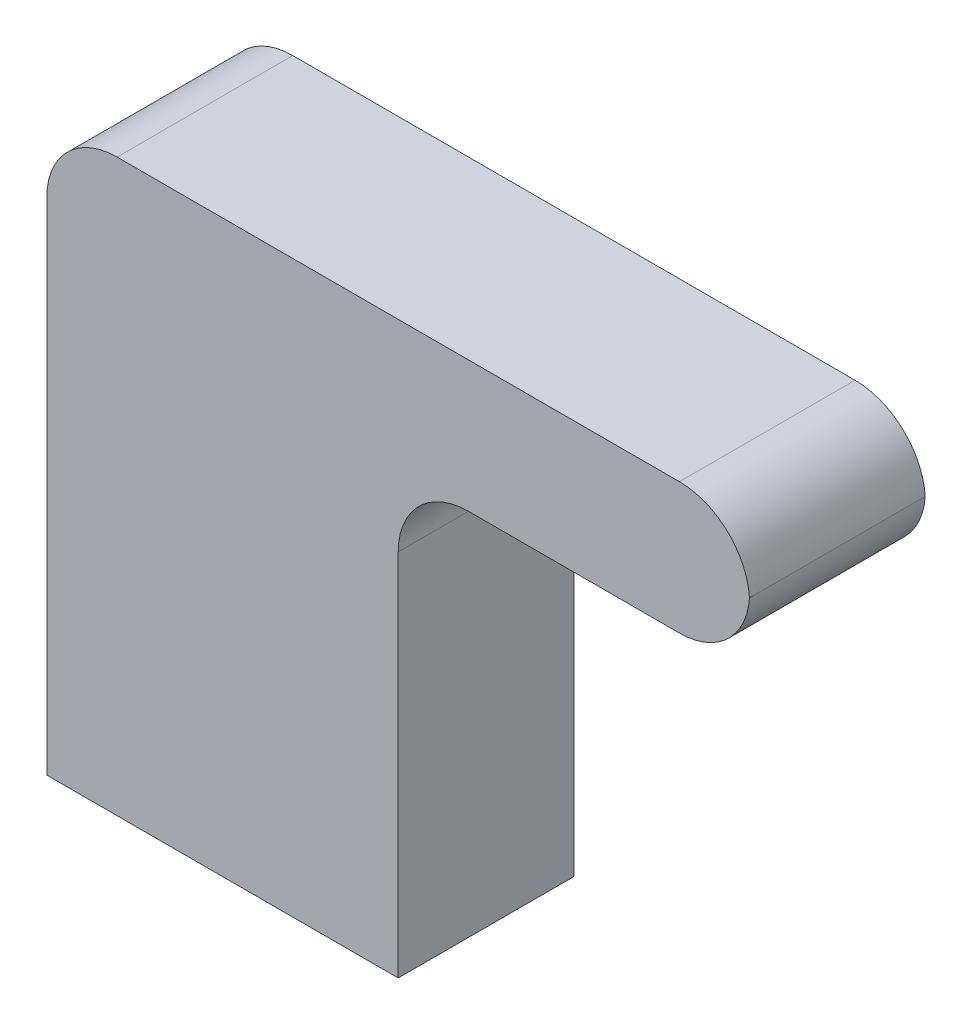
ISO-10303-21;
HEADER;
FILE_DESCRIPTION(('STEP AP214'),'2;1');
FILE_NAME('part.step','',(''),(''),'','','');
FILE_SCHEMA(('AUTOMOTIVE_DESIGN { 1 0 10303 214 1 1 1 1 }'));
ENDSEC;
DATA;
#1=APPLICATION_CONTEXT('core data for automotive mechanical design processes');
#2=APPLICATION_PROTOCOL_DEFINITION('international standard','automotive_design',2000,#1);
#3=PRODUCT_CONTEXT('',#1,'mechanical');
#4=PRODUCT('Part','Part','',(#3));
#5=PRODUCT_RELATED_PRODUCT_CATEGORY('part','',(#4));
#6=PRODUCT_DEFINITION_FORMATION('','',#4);
#7=PRODUCT_DEFINITION_CONTEXT('part definition',#1,'design');
#8=PRODUCT_DEFINITION('design','',#6,#7);
#9=PRODUCT_DEFINITION_SHAPE('','',#8);
#10=(LENGTH_UNIT() NAMED_UNIT(*) SI_UNIT(.MILLI.,.METRE.));
#11=(NAMED_UNIT(*) PLANE_ANGLE_UNIT() SI_UNIT($,.RADIAN.));
#12=(NAMED_UNIT(*) SI_UNIT($,.STERADIAN.) SOLID_ANGLE_UNIT());
#13=UNCERTAINTY_MEASURE_WITH_UNIT(LENGTH_MEASURE(1.E-05),#10,'distance_accuracy_value','');
#14=(GEOMETRIC_REPRESENTATION_CONTEXT(3) GLOBAL_UNCERTAINTY_ASSIGNED_CONTEXT((#13)) GLOBAL_UNIT_ASSIGNED_CONTEXT((#10,
#11,#12)) REPRESENTATION_CONTEXT('',''));
#15=CARTESIAN_POINT('',(0.,0.,0.));
#16=DIRECTION('',(0.,0.,1.));
#17=DIRECTION('',(1.,0.,0.));
#18=AXIS2_PLACEMENT_3D('',#15,#16,#17);
#19=CARTESIAN_POINT('',(-12.7,0.,6.35));
#20=DIRECTION('',(0.,1.,0.));
#21=DIRECTION('',(0.,0.,1.));
#22=AXIS2_PLACEMENT_3D('',#19,#20,#21);
#23=PLANE('',#22);
#24=DIRECTION('',(1.,0.,0.));
#25=VECTOR('',#24,1.);
#26=CARTESIAN_POINT('',(-12.7,0.,0.));
#27=LINE('',#26,#25);
#28=CARTESIAN_POINT('',(-12.7,0.,0.));
#29=VERTEX_POINT('',#28);
#30=CARTESIAN_POINT('',(0.,0.,0.));
#31=VERTEX_POINT('',#30);
#32=EDGE_CURVE('E126',#29,#31,#27,.T.);
#33=ORIENTED_EDGE('',*,*,#32,.T.);
#34=DIRECTION('',(0.,0.,-1.));
#35=VECTOR('',#34,1.);
#36=CARTESIAN_POINT('',(0.,0.,6.35));
#37=LINE('',#36,#35);
#38=CARTESIAN_POINT('',(0.,0.,6.35));
#39=VERTEX_POINT('',#38);
#40=EDGE_CURVE('E109',#39,#31,#37,.T.);
#41=ORIENTED_EDGE('',*,*,#40,.F.);
#42=DIRECTION('',(1.,0.,0.));
#43=VECTOR('',#42,1.);
#44=CARTESIAN_POINT('',(-12.7,0.,6.35));
#45=LINE('',#44,#43);
#46=CARTESIAN_POINT('',(-12.7,0.,6.35));
#47=VERTEX_POINT('',#46);
#48=EDGE_CURVE('E115',#47,#39,#45,.T.);
#49=ORIENTED_EDGE('',*,*,#48,.F.);
#50=DIRECTION('',(0.,0.,-1.));
#51=VECTOR('',#50,1.);
#52=CARTESIAN_POINT('',(-12.7,0.,6.35));
#53=LINE('',#52,#51);
#54=EDGE_CURVE('E128',#47,#29,#53,.T.);
#55=ORIENTED_EDGE('',*,*,#54,.T.);
#56=EDGE_LOOP('',(#33,#41,#49,#55));
#57=FACE_BOUND('',#56,.T.);
#58=ADVANCED_FACE('F33',(#57),#23,.F.);
#59=CARTESIAN_POINT('',(0.,0.,6.35));
#60=DIRECTION('',(-1.,0.,0.));
#61=DIRECTION('',(0.,0.,1.));
#62=AXIS2_PLACEMENT_3D('',#59,#60,#61);
#63=PLANE('',#62);
#64=DIRECTION('',(0.,1.,0.));
#65=VECTOR('',#64,1.);
#66=CARTESIAN_POINT('',(0.,0.,0.));
#67=LINE('',#66,#65);
#68=CARTESIAN_POINT('',(0.,13.335,0.));
#69=VERTEX_POINT('',#68);
#70=EDGE_CURVE('E159',#31,#69,#67,.T.);
#71=ORIENTED_EDGE('',*,*,#70,.T.);
#72=DIRECTION('',(0.,0.,-1.));
#73=VECTOR('',#72,1.);
#74=CARTESIAN_POINT('',(0.,13.335,6.35));
#75=LINE('',#74,#73);
#76=CARTESIAN_POINT('',(0.,13.335,6.35));
#77=VERTEX_POINT('',#76);
#78=EDGE_CURVE('E112',#69,#77,#75,.F.);
#79=ORIENTED_EDGE('',*,*,#78,.T.);
#80=DIRECTION('',(0.,1.,0.));
#81=VECTOR('',#80,1.);
#82=CARTESIAN_POINT('',(0.,0.,6.35));
#83=LINE('',#82,#81);
#84=EDGE_CURVE('E104',#39,#77,#83,.T.);
#85=ORIENTED_EDGE('',*,*,#84,.F.);
#86=ORIENTED_EDGE('',*,*,#40,.T.);
#87=EDGE_LOOP('',(#71,#79,#85,#86));
#88=FACE_BOUND('',#87,.T.);
#89=ADVANCED_FACE('F107',(#88),#63,.F.);
#90=CARTESIAN_POINT('',(0.,15.875,6.35));
#91=DIRECTION('',(0.,1.,0.));
#92=DIRECTION('',(0.,0.,1.));
#93=AXIS2_PLACEMENT_3D('',#90,#91,#92);
#94=PLANE('',#93);
#95=DIRECTION('',(1.,0.,0.));
#96=VECTOR('',#95,1.);
#97=CARTESIAN_POINT('',(0.,15.875,0.));
#98=LINE('',#97,#96);
#99=CARTESIAN_POINT('',(2.54,15.875,0.));
#100=VERTEX_POINT('',#99);
#101=CARTESIAN_POINT('',(10.16,15.875,0.));
#102=VERTEX_POINT('',#101);
#103=EDGE_CURVE('E161',#100,#102,#98,.T.);
#104=ORIENTED_EDGE('',*,*,#103,.T.);
#105=DIRECTION('',(0.,0.,-1.));
#106=VECTOR('',#105,1.);
#107=CARTESIAN_POINT('',(10.16,15.875,6.35));
#108=LINE('',#107,#106);
#109=CARTESIAN_POINT('',(10.16,15.875,6.35));
#110=VERTEX_POINT('',#109);
#111=EDGE_CURVE('E141',#102,#110,#108,.F.);
#112=ORIENTED_EDGE('',*,*,#111,.T.);
#113=DIRECTION('',(1.,0.,0.));
#114=VECTOR('',#113,1.);
#115=CARTESIAN_POINT('',(0.,15.875,6.35));
#116=LINE('',#115,#114);
#117=CARTESIAN_POINT('',(2.54,15.875,6.35));
#118=VERTEX_POINT('',#117);
#119=EDGE_CURVE('E114',#118,#110,#116,.T.);
#120=ORIENTED_EDGE('',*,*,#119,.F.);
#121=DIRECTION('',(0.,0.,-1.));
#122=VECTOR('',#121,1.);
#123=CARTESIAN_POINT('',(2.54,15.875,0.));
#124=LINE('',#123,#122);
#125=EDGE_CURVE('E138',#118,#100,#124,.T.);
#126=ORIENTED_EDGE('',*,*,#125,.T.);
#127=EDGE_LOOP('',(#104,#112,#120,#126));
#128=FACE_BOUND('',#127,.T.);
#129=ADVANCED_FACE('F167',(#128),#94,.F.);
#130=CARTESIAN_POINT('',(12.7,20.6121,6.35));
#131=DIRECTION('',(0.,-1.,0.));
#132=DIRECTION('',(0.,0.,-1.));
#133=AXIS2_PLACEMENT_3D('',#130,#131,#132);
#134=PLANE('',#133);
#135=DIRECTION('',(-1.,0.,0.));
#136=VECTOR('',#135,1.);
#137=CARTESIAN_POINT('',(12.7,20.6121,6.35));
#138=LINE('',#137,#136);
#139=CARTESIAN_POINT('',(10.16,20.6121,6.35));
#140=VERTEX_POINT('',#139);
#141=CARTESIAN_POINT('',(-10.16,20.6121,6.35));
#142=VERTEX_POINT('',#141);
#143=EDGE_CURVE('E169',#140,#142,#138,.T.);
#144=ORIENTED_EDGE('',*,*,#143,.F.);
#145=DIRECTION('',(0.,0.,-1.));
#146=VECTOR('',#145,1.);
#147=CARTESIAN_POINT('',(10.16,20.6121,6.35));
#148=LINE('',#147,#146);
#149=CARTESIAN_POINT('',(10.16,20.6121,0.));
#150=VERTEX_POINT('',#149);
#151=EDGE_CURVE('E150',#140,#150,#148,.T.);
#152=ORIENTED_EDGE('',*,*,#151,.T.);
#153=DIRECTION('',(-1.,0.,0.));
#154=VECTOR('',#153,1.);
#155=CARTESIAN_POINT('',(12.7,20.6121,0.));
#156=LINE('',#155,#154);
#157=CARTESIAN_POINT('',(-10.16,20.6121,0.));
#158=VERTEX_POINT('',#157);
#159=EDGE_CURVE('E176',#150,#158,#156,.T.);
#160=ORIENTED_EDGE('',*,*,#159,.T.);
#161=DIRECTION('',(0.,0.,-1.));
#162=VECTOR('',#161,1.);
#163=CARTESIAN_POINT('',(-10.16,20.6121,6.35));
#164=LINE('',#163,#162);
#165=EDGE_CURVE('E148',#158,#142,#164,.F.);
#166=ORIENTED_EDGE('',*,*,#165,.T.);
#167=EDGE_LOOP('',(#144,#152,#160,#166));
#168=FACE_BOUND('',#167,.T.);
#169=ADVANCED_FACE('F188',(#168),#134,.F.);
#170=CARTESIAN_POINT('',(-12.7,20.6121,6.35));
#171=DIRECTION('',(1.,0.,0.));
#172=DIRECTION('',(0.,0.,-1.));
#173=AXIS2_PLACEMENT_3D('',#170,#171,#172);
#174=PLANE('',#173);
#175=DIRECTION('',(0.,-1.,0.));
#176=VECTOR('',#175,1.);
#177=CARTESIAN_POINT('',(-12.7,20.6121,6.35));
#178=LINE('',#177,#176);
#179=CARTESIAN_POINT('',(-12.7,18.0721,6.35));
#180=VERTEX_POINT('',#179);
#181=EDGE_CURVE('E119',#180,#47,#178,.T.);
#182=ORIENTED_EDGE('',*,*,#181,.F.);
#183=DIRECTION('',(0.,0.,-1.));
#184=VECTOR('',#183,1.);
#185=CARTESIAN_POINT('',(-12.7,18.0721,6.35));
#186=LINE('',#185,#184);
#187=CARTESIAN_POINT('',(-12.7,18.0721,0.));
#188=VERTEX_POINT('',#187);
#189=EDGE_CURVE('E152',#180,#188,#186,.T.);
#190=ORIENTED_EDGE('',*,*,#189,.T.);
#191=DIRECTION('',(0.,-1.,0.));
#192=VECTOR('',#191,1.);
#193=CARTESIAN_POINT('',(-12.7,20.6121,0.));
#194=LINE('',#193,#192);
#195=EDGE_CURVE('E123',#188,#29,#194,.T.);
#196=ORIENTED_EDGE('',*,*,#195,.T.);
#197=ORIENTED_EDGE('',*,*,#54,.F.);
#198=EDGE_LOOP('',(#182,#190,#196,#197));
#199=FACE_BOUND('',#198,.T.);
#200=ADVANCED_FACE('F180',(#199),#174,.F.);
#201=CARTESIAN_POINT('',(0.,0.,6.35));
#202=DIRECTION('',(0.,0.,1.));
#203=DIRECTION('',(1.,0.,0.));
#204=AXIS2_PLACEMENT_3D('',#201,#202,#203);
#205=PLANE('',#204);
#206=ORIENTED_EDGE('',*,*,#119,.T.);
#207=CARTESIAN_POINT('',(10.16,18.415,6.35));
#208=DIRECTION('',(0.,0.,1.));
#209=DIRECTION('',(1.,0.,0.));
#210=AXIS2_PLACEMENT_3D('',#207,#208,#209);
#211=CIRCLE('',#210,2.54);
#212=CARTESIAN_POINT('',(12.6942069563278,18.24355,6.35));
#213=VERTEX_POINT('',#212);
#214=EDGE_CURVE('E49',#110,#213,#211,.T.);
#215=ORIENTED_EDGE('',*,*,#214,.T.);
#216=CARTESIAN_POINT('',(10.16,18.0721,6.35));
#217=DIRECTION('',(0.,0.,1.));
#218=DIRECTION('',(1.,0.,0.));
#219=AXIS2_PLACEMENT_3D('',#216,#217,#218);
#220=CIRCLE('',#219,2.54);
#221=EDGE_CURVE('E145',#213,#140,#220,.T.);
#222=ORIENTED_EDGE('',*,*,#221,.T.);
#223=ORIENTED_EDGE('',*,*,#143,.T.);
#224=CARTESIAN_POINT('',(-10.16,18.0721,6.35));
#225=DIRECTION('',(0.,0.,1.));
#226=DIRECTION('',(1.,0.,0.));
#227=AXIS2_PLACEMENT_3D('',#224,#225,#226);
#228=CIRCLE('',#227,2.54);
#229=EDGE_CURVE('E56',#142,#180,#228,.T.);
#230=ORIENTED_EDGE('',*,*,#229,.T.);
#231=ORIENTED_EDGE('',*,*,#181,.T.);
#232=ORIENTED_EDGE('',*,*,#48,.T.);
#233=ORIENTED_EDGE('',*,*,#84,.T.);
#234=CARTESIAN_POINT('',(2.54,13.335,6.35));
#235=DIRECTION('',(0.,0.,1.));
#236=DIRECTION('',(1.,0.,0.));
#237=AXIS2_PLACEMENT_3D('',#234,#235,#236);
#238=CIRCLE('',#237,2.54);
#239=EDGE_CURVE('E11',#77,#118,#238,.F.);
#240=ORIENTED_EDGE('',*,*,#239,.T.);
#241=EDGE_LOOP('',(#206,#215,#222,#223,#230,#231,#232,#233,#240));
#242=FACE_BOUND('',#241,.T.);
#243=ADVANCED_FACE('F118',(#242),#205,.T.);
#244=CARTESIAN_POINT('',(0.,0.,0.));
#245=DIRECTION('',(0.,0.,1.));
#246=DIRECTION('',(1.,0.,0.));
#247=AXIS2_PLACEMENT_3D('',#244,#245,#246);
#248=PLANE('',#247);
#249=CARTESIAN_POINT('',(10.16,18.0721,0.));
#250=DIRECTION('',(0.,0.,1.));
#251=DIRECTION('',(1.,0.,0.));
#252=AXIS2_PLACEMENT_3D('',#249,#250,#251);
#253=CIRCLE('',#252,2.54);
#254=CARTESIAN_POINT('',(12.6942069563278,18.24355,0.));
#255=VERTEX_POINT('',#254);
#256=EDGE_CURVE('E130',#150,#255,#253,.F.);
#257=ORIENTED_EDGE('',*,*,#256,.T.);
#258=CARTESIAN_POINT('',(10.16,18.415,0.));
#259=DIRECTION('',(0.,0.,1.));
#260=DIRECTION('',(1.,0.,0.));
#261=AXIS2_PLACEMENT_3D('',#258,#259,#260);
#262=CIRCLE('',#261,2.54);
#263=EDGE_CURVE('E136',#255,#102,#262,.F.);
#264=ORIENTED_EDGE('',*,*,#263,.T.);
#265=ORIENTED_EDGE('',*,*,#103,.F.);
#266=CARTESIAN_POINT('',(2.54,13.335,0.));
#267=DIRECTION('',(0.,0.,1.));
#268=DIRECTION('',(1.,0.,0.));
#269=AXIS2_PLACEMENT_3D('',#266,#267,#268);
#270=CIRCLE('',#269,2.54);
#271=EDGE_CURVE('E42',#100,#69,#270,.T.);
#272=ORIENTED_EDGE('',*,*,#271,.T.);
#273=ORIENTED_EDGE('',*,*,#70,.F.);
#274=ORIENTED_EDGE('',*,*,#32,.F.);
#275=ORIENTED_EDGE('',*,*,#195,.F.);
#276=CARTESIAN_POINT('',(-10.16,18.0721,0.));
#277=DIRECTION('',(0.,0.,1.));
#278=DIRECTION('',(1.,0.,0.));
#279=AXIS2_PLACEMENT_3D('',#276,#277,#278);
#280=CIRCLE('',#279,2.54);
#281=EDGE_CURVE('E127',#188,#158,#280,.F.);
#282=ORIENTED_EDGE('',*,*,#281,.T.);
#283=ORIENTED_EDGE('',*,*,#159,.F.);
#284=EDGE_LOOP('',(#257,#264,#265,#272,#273,#274,#275,#282,#283));
#285=FACE_BOUND('',#284,.T.);
#286=ADVANCED_FACE('F158',(#285),#248,.F.);
#287=CARTESIAN_POINT('',(10.16,18.0721,6.35));
#288=DIRECTION('',(0.,0.,-1.));
#289=DIRECTION('',(-1.,0.,0.));
#290=AXIS2_PLACEMENT_3D('',#287,#288,#289);
#291=CYLINDRICAL_SURFACE('',#290,2.54);
#292=ORIENTED_EDGE('',*,*,#151,.F.);
#293=ORIENTED_EDGE('',*,*,#221,.F.);
#294=DIRECTION('',(0.,0.,-1.));
#295=VECTOR('',#294,1.);
#296=CARTESIAN_POINT('',(12.6942069563278,18.24355,3.175));
#297=LINE('',#296,#295);
#298=EDGE_CURVE('E37',#255,#213,#297,.F.);
#299=ORIENTED_EDGE('',*,*,#298,.F.);
#300=ORIENTED_EDGE('',*,*,#256,.F.);
#301=EDGE_LOOP('',(#292,#293,#299,#300));
#302=FACE_BOUND('',#301,.T.);
#303=ADVANCED_FACE('F197',(#302),#291,.T.);
#304=CARTESIAN_POINT('',(10.16,18.415,6.35));
#305=DIRECTION('',(0.,0.,-1.));
#306=DIRECTION('',(-1.,0.,0.));
#307=AXIS2_PLACEMENT_3D('',#304,#305,#306);
#308=CYLINDRICAL_SURFACE('',#307,2.54);
#309=ORIENTED_EDGE('',*,*,#214,.F.);
#310=ORIENTED_EDGE('',*,*,#111,.F.);
#311=ORIENTED_EDGE('',*,*,#263,.F.);
#312=ORIENTED_EDGE('',*,*,#298,.T.);
#313=EDGE_LOOP('',(#309,#310,#311,#312));
#314=FACE_BOUND('',#313,.T.);
#315=ADVANCED_FACE('F192',(#314),#308,.T.);
#316=CARTESIAN_POINT('',(-10.16,18.0721,6.35));
#317=DIRECTION('',(0.,0.,-1.));
#318=DIRECTION('',(-1.,0.,0.));
#319=AXIS2_PLACEMENT_3D('',#316,#317,#318);
#320=CYLINDRICAL_SURFACE('',#319,2.54);
#321=ORIENTED_EDGE('',*,*,#229,.F.);
#322=ORIENTED_EDGE('',*,*,#165,.F.);
#323=ORIENTED_EDGE('',*,*,#281,.F.);
#324=ORIENTED_EDGE('',*,*,#189,.F.);
#325=EDGE_LOOP('',(#321,#322,#323,#324));
#326=FACE_BOUND('',#325,.T.);
#327=ADVANCED_FACE('F190',(#326),#320,.T.);
#328=CARTESIAN_POINT('',(2.54,13.335,6.35));
#329=DIRECTION('',(0.,0.,1.));
#330=DIRECTION('',(1.,0.,0.));
#331=AXIS2_PLACEMENT_3D('',#328,#329,#330);
#332=CYLINDRICAL_SURFACE('',#331,2.54);
#333=ORIENTED_EDGE('',*,*,#239,.F.);
#334=ORIENTED_EDGE('',*,*,#78,.F.);
#335=ORIENTED_EDGE('',*,*,#271,.F.);
#336=ORIENTED_EDGE('',*,*,#125,.F.);
#337=EDGE_LOOP('',(#333,#334,#335,#336));
#338=FACE_BOUND('',#337,.T.);
#339=ADVANCED_FACE('F35',(#338),#332,.F.);
#340=CLOSED_SHELL('',(#58,#89,#129,#169,#200,#243,#286,#303,#315,#327,#339));
#341=MANIFOLD_SOLID_BREP('B2',#340);
#342=ADVANCED_BREP_SHAPE_REPRESENTATION('',(#18,#341),#14);
#343=SHAPE_DEFINITION_REPRESENTATION(#9,#342);
ENDSEC;
END-ISO-10303-21;
